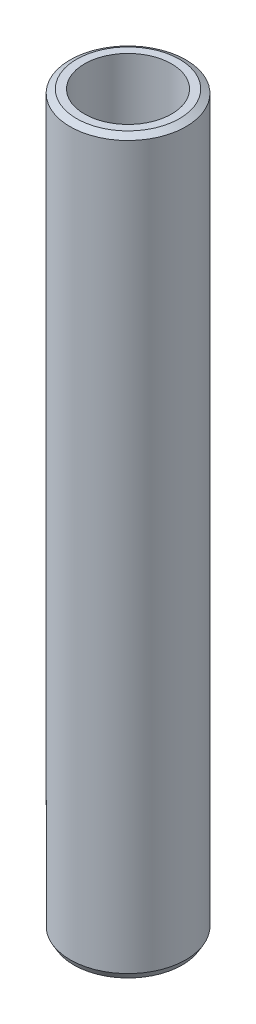
ISO-10303-21;
HEADER;
FILE_DESCRIPTION(('STEP AP214'),'2;1');
FILE_NAME('part.step','',(''),(''),'','','');
FILE_SCHEMA(('AUTOMOTIVE_DESIGN { 1 0 10303 214 1 1 1 1 }'));
ENDSEC;
DATA;
#1=APPLICATION_CONTEXT('core data for automotive mechanical design processes');
#2=APPLICATION_PROTOCOL_DEFINITION('international standard','automotive_design',2000,#1);
#3=PRODUCT_CONTEXT('',#1,'mechanical');
#4=PRODUCT('Part','Part','',(#3));
#5=PRODUCT_RELATED_PRODUCT_CATEGORY('part','',(#4));
#6=PRODUCT_DEFINITION_FORMATION('','',#4);
#7=PRODUCT_DEFINITION_CONTEXT('part definition',#1,'design');
#8=PRODUCT_DEFINITION('design','',#6,#7);
#9=PRODUCT_DEFINITION_SHAPE('','',#8);
#10=(LENGTH_UNIT() NAMED_UNIT(*) SI_UNIT(.MILLI.,.METRE.));
#11=(NAMED_UNIT(*) PLANE_ANGLE_UNIT() SI_UNIT($,.RADIAN.));
#12=(NAMED_UNIT(*) SI_UNIT($,.STERADIAN.) SOLID_ANGLE_UNIT());
#13=UNCERTAINTY_MEASURE_WITH_UNIT(LENGTH_MEASURE(1.E-05),#10,'distance_accuracy_value','');
#14=(GEOMETRIC_REPRESENTATION_CONTEXT(3) GLOBAL_UNCERTAINTY_ASSIGNED_CONTEXT((#13)) GLOBAL_UNIT_ASSIGNED_CONTEXT((#10,
#11,#12)) REPRESENTATION_CONTEXT('',''));
#15=CARTESIAN_POINT('',(0.,0.,0.));
#16=DIRECTION('',(0.,0.,1.));
#17=DIRECTION('',(1.,0.,0.));
#18=AXIS2_PLACEMENT_3D('',#15,#16,#17);
#19=CARTESIAN_POINT('',(0.,600.,0.));
#20=DIRECTION('',(0.,-1.,0.));
#21=DIRECTION('',(0.,0.,-1.));
#22=AXIS2_PLACEMENT_3D('',#19,#20,#21);
#23=CYLINDRICAL_SURFACE('',#22,47.5);
#24=CARTESIAN_POINT('',(0.,596.937892581674,0.));
#25=DIRECTION('',(0.,1.,0.));
#26=DIRECTION('',(0.,0.,1.));
#27=AXIS2_PLACEMENT_3D('',#24,#25,#26);
#28=CIRCLE('',#27,47.5);
#29=CARTESIAN_POINT('',(0.,596.937892581674,-47.5000000000001));
#30=VERTEX_POINT('',#29);
#31=EDGE_CURVE('E50',#30,#30,#28,.F.);
#32=ORIENTED_EDGE('',*,*,#31,.T.);
#33=EDGE_LOOP('',(#32));
#34=FACE_BOUND('',#33,.T.);
#35=CARTESIAN_POINT('',(0.,5.30372562677439,0.));
#36=DIRECTION('',(0.,1.,0.));
#37=DIRECTION('',(0.,0.,1.));
#38=AXIS2_PLACEMENT_3D('',#35,#36,#37);
#39=CIRCLE('',#38,47.5);
#40=CARTESIAN_POINT('',(0.,5.30372562677439,47.5));
#41=VERTEX_POINT('',#40);
#42=EDGE_CURVE('E51',#41,#41,#39,.T.);
#43=ORIENTED_EDGE('',*,*,#42,.T.);
#44=EDGE_LOOP('',(#43));
#45=FACE_BOUND('',#44,.T.);
#46=ADVANCED_FACE('F39',(#34,#45),#23,.T.);
#47=CARTESIAN_POINT('',(0.,600.,0.));
#48=DIRECTION('',(0.,1.,0.));
#49=DIRECTION('',(0.,0.,1.));
#50=AXIS2_PLACEMENT_3D('',#47,#48,#49);
#51=PLANE('',#50);
#52=CARTESIAN_POINT('',(0.,600.,0.));
#53=DIRECTION('',(0.,1.,0.));
#54=DIRECTION('',(0.,0.,1.));
#55=AXIS2_PLACEMENT_3D('',#52,#53,#54);
#56=CIRCLE('',#55,42.1962743732255);
#57=CARTESIAN_POINT('',(0.,600.,-42.1962743732256));
#58=VERTEX_POINT('',#57);
#59=EDGE_CURVE('E54',#58,#58,#56,.T.);
#60=ORIENTED_EDGE('',*,*,#59,.T.);
#61=EDGE_LOOP('',(#60));
#62=FACE_BOUND('',#61,.T.);
#63=CARTESIAN_POINT('',(0.,600.,0.));
#64=DIRECTION('',(0.,1.,0.));
#65=DIRECTION('',(0.,0.,1.));
#66=AXIS2_PLACEMENT_3D('',#63,#64,#65);
#67=CIRCLE('',#66,35.6935095895603);
#68=CARTESIAN_POINT('',(0.,600.,35.6935095895603));
#69=VERTEX_POINT('',#68);
#70=EDGE_CURVE('E58',#69,#69,#67,.T.);
#71=ORIENTED_EDGE('',*,*,#70,.F.);
#72=EDGE_LOOP('',(#71));
#73=FACE_BOUND('',#72,.T.);
#74=ADVANCED_FACE('F69',(#62,#73),#51,.T.);
#75=CARTESIAN_POINT('',(0.,0.,0.));
#76=DIRECTION('',(0.,1.,0.));
#77=DIRECTION('',(0.,0.,1.));
#78=AXIS2_PLACEMENT_3D('',#75,#76,#77);
#79=PLANE('',#78);
#80=CARTESIAN_POINT('',(0.,0.,0.));
#81=DIRECTION('',(0.,1.,0.));
#82=DIRECTION('',(0.,0.,1.));
#83=AXIS2_PLACEMENT_3D('',#80,#81,#82);
#84=CIRCLE('',#83,44.4378925816739);
#85=CARTESIAN_POINT('',(0.,0.,44.4378925816739));
#86=VERTEX_POINT('',#85);
#87=EDGE_CURVE('E10',#86,#86,#84,.F.);
#88=ORIENTED_EDGE('',*,*,#87,.T.);
#89=EDGE_LOOP('',(#88));
#90=FACE_BOUND('',#89,.T.);
#91=CARTESIAN_POINT('',(0.,0.,0.));
#92=DIRECTION('',(0.,1.,0.));
#93=DIRECTION('',(0.,0.,1.));
#94=AXIS2_PLACEMENT_3D('',#91,#92,#93);
#95=CIRCLE('',#94,35.6935095895603);
#96=CARTESIAN_POINT('',(0.,0.,35.6935095895603));
#97=VERTEX_POINT('',#96);
#98=EDGE_CURVE('E63',#97,#97,#95,.T.);
#99=ORIENTED_EDGE('',*,*,#98,.T.);
#100=EDGE_LOOP('',(#99));
#101=FACE_BOUND('',#100,.T.);
#102=ADVANCED_FACE('F75',(#90,#101),#79,.F.);
#103=CARTESIAN_POINT('',(0.,600.,0.));
#104=DIRECTION('',(0.,-1.,0.));
#105=DIRECTION('',(0.,0.,-1.));
#106=AXIS2_PLACEMENT_3D('',#103,#104,#105);
#107=CYLINDRICAL_SURFACE('',#106,35.6935095895603);
#108=ORIENTED_EDGE('',*,*,#70,.T.);
#109=EDGE_LOOP('',(#108));
#110=FACE_BOUND('',#109,.T.);
#111=ORIENTED_EDGE('',*,*,#98,.F.);
#112=EDGE_LOOP('',(#111));
#113=FACE_BOUND('',#112,.T.);
#114=ADVANCED_FACE('F70',(#110,#113),#107,.F.);
#115=CARTESIAN_POINT('',(0.,600.,0.));
#116=DIRECTION('',(0.,-1.,0.));
#117=DIRECTION('',(0.,0.,-1.));
#118=AXIS2_PLACEMENT_3D('',#115,#116,#117);
#119=CONICAL_SURFACE('',#118,42.1962743732255,1.04719755119659);
#120=CARTESIAN_POINT('',(0.,596.937892581674,-47.5000000000001));
#121=CARTESIAN_POINT('',(0.,596.969789533948,-47.4447528580545));
#122=CARTESIAN_POINT('',(0.,597.001686486222,-47.389505716109));
#123=CARTESIAN_POINT('',(0.,597.065480390771,-47.2790114322178));
#124=CARTESIAN_POINT('',(0.,597.097377343045,-47.2237642902723));
#125=CARTESIAN_POINT('',(0.,597.161171247593,-47.1132700063811));
#126=CARTESIAN_POINT('',(0.,597.193068199868,-47.0580228644356));
#127=CARTESIAN_POINT('',(0.,597.256862104416,-46.9475285805444));
#128=CARTESIAN_POINT('',(0.,597.28875905669,-46.8922814385989));
#129=CARTESIAN_POINT('',(0.,597.352552961239,-46.7817871547077));
#130=CARTESIAN_POINT('',(0.,597.384449913513,-46.7265400127622));
#131=CARTESIAN_POINT('',(0.,597.448243818061,-46.616045728871));
#132=CARTESIAN_POINT('',(0.,597.480140770336,-46.5607985869254));
#133=CARTESIAN_POINT('',(0.,597.543934674884,-46.4503043030343));
#134=CARTESIAN_POINT('',(0.,597.575831627158,-46.3950571610887));
#135=CARTESIAN_POINT('',(0.,597.639625531707,-46.2845628771976));
#136=CARTESIAN_POINT('',(0.,597.671522483981,-46.229315735252));
#137=CARTESIAN_POINT('',(0.,597.73531638853,-46.1188214513609));
#138=CARTESIAN_POINT('',(0.,597.767213340804,-46.0635743094153));
#139=CARTESIAN_POINT('',(0.,597.831007245352,-45.9530800255242));
#140=CARTESIAN_POINT('',(0.,597.862904197626,-45.8978328835786));
#141=CARTESIAN_POINT('',(0.,597.926698102175,-45.7873385996875));
#142=CARTESIAN_POINT('',(0.,597.958595054449,-45.7320914577419));
#143=CARTESIAN_POINT('',(0.,598.022388958997,-45.6215971738508));
#144=CARTESIAN_POINT('',(0.,598.054285911272,-45.5663500319052));
#145=CARTESIAN_POINT('',(0.,598.11807981582,-45.4558557480141));
#146=CARTESIAN_POINT('',(0.,598.149976768094,-45.4006086060685));
#147=CARTESIAN_POINT('',(0.,598.213770672643,-45.2901143221774));
#148=CARTESIAN_POINT('',(0.,598.245667624917,-45.2348671802318));
#149=CARTESIAN_POINT('',(0.,598.309461529466,-45.1243728963407));
#150=CARTESIAN_POINT('',(0.,598.34135848174,-45.0691257543951));
#151=CARTESIAN_POINT('',(0.,598.405152386288,-44.958631470504));
#152=CARTESIAN_POINT('',(0.,598.437049338563,-44.9033843285584));
#153=CARTESIAN_POINT('',(0.,598.500843243111,-44.7928900446673));
#154=CARTESIAN_POINT('',(0.,598.532740195385,-44.7376429027217));
#155=CARTESIAN_POINT('',(0.,598.596534099934,-44.6271486188306));
#156=CARTESIAN_POINT('',(0.,598.628431052208,-44.571901476885));
#157=CARTESIAN_POINT('',(0.,598.692224956756,-44.4614071929939));
#158=CARTESIAN_POINT('',(0.,598.724121909031,-44.4061600510483));
#159=CARTESIAN_POINT('',(0.,598.787915813579,-44.2956657671572));
#160=CARTESIAN_POINT('',(0.,598.819812765853,-44.2404186252116));
#161=CARTESIAN_POINT('',(0.,598.883606670402,-44.1299243413205));
#162=CARTESIAN_POINT('',(0.,598.915503622676,-44.0746771993749));
#163=CARTESIAN_POINT('',(0.,598.979297527225,-43.9641829154838));
#164=CARTESIAN_POINT('',(0.,599.011194479499,-43.9089357735382));
#165=CARTESIAN_POINT('',(0.,599.074988384047,-43.798441489647));
#166=CARTESIAN_POINT('',(0.,599.106885336321,-43.7431943477015));
#167=CARTESIAN_POINT('',(0.,599.17067924087,-43.6327000638103));
#168=CARTESIAN_POINT('',(0.,599.202576193144,-43.5774529218648));
#169=CARTESIAN_POINT('',(0.,599.266370097693,-43.4669586379736));
#170=CARTESIAN_POINT('',(0.,599.298267049967,-43.4117114960281));
#171=CARTESIAN_POINT('',(0.,599.362060954515,-43.3012172121369));
#172=CARTESIAN_POINT('',(0.,599.39395790679,-43.2459700701914));
#173=CARTESIAN_POINT('',(0.,599.457751811338,-43.1354757863002));
#174=CARTESIAN_POINT('',(0.,599.489648763612,-43.0802286443547));
#175=CARTESIAN_POINT('',(0.,599.553442668161,-42.9697343604635));
#176=CARTESIAN_POINT('',(0.,599.585339620435,-42.914487218518));
#177=CARTESIAN_POINT('',(0.,599.649133524983,-42.8039929346268));
#178=CARTESIAN_POINT('',(0.,599.681030477258,-42.7487457926813));
#179=CARTESIAN_POINT('',(0.,599.744824381806,-42.6382515087901));
#180=CARTESIAN_POINT('',(0.,599.77672133408,-42.5830043668446));
#181=CARTESIAN_POINT('',(0.,599.840515238629,-42.4725100829534));
#182=CARTESIAN_POINT('',(0.,599.872412190903,-42.4172629410079));
#183=CARTESIAN_POINT('',(0.,599.936206095452,-42.3067686571167));
#184=CARTESIAN_POINT('',(0.,599.968103047726,-42.2515215151711));
#185=CARTESIAN_POINT('',(0.,600.,-42.1962743732256));
#186=B_SPLINE_CURVE_WITH_KNOTS('',3,(#120,#121,#122,#123,#124,#125,#126,#127,#128,#129,#130,
#131,#132,#133,#134,#135,#136,#137,#138,#139,#140,#141,#142,#143,#144,#145,#146,#147,#148,#149,
#150,#151,#152,#153,#154,#155,#156,#157,#158,#159,#160,#161,#162,#163,#164,#165,#166,#167,#168,
#169,#170,#171,#172,#173,#174,#175,#176,#177,#178,#179,#180,#181,#182,#183,#184,#185),
.UNSPECIFIED.,.F.,.F.,(4,2,2,2,2,2,2,2,2,2,2,2,2,2,2,2,2,2,2,2,2,2,2,2,2,2,2,2,2,2,2,2,4),(0.,
0.191381713645392,0.382763427290784,0.574145140936177,0.765526854581569,0.956908568226961,
1.14829028187236,1.33967199551775,1.53105370916314,1.72243542280854,1.91381713645393,
2.10519885009926,2.29658056374466,2.48796227739005,2.67934399103544,2.87072570468083,
3.06210741832623,3.25348913197163,3.44487084561702,3.63625255926241,3.8276342729078,
4.01901598655319,4.21039770019853,4.40177941384392,4.59316112748931,4.78454284113471,
4.9759245547801,5.1673062684255,5.35868798207089,5.55006969571628,5.74145140936167,
5.93283312300706,6.12421483665246),.UNSPECIFIED.);
#187=EDGE_CURVE('BSEAM81',#30,#58,#186,.T.);
#188=ORIENTED_EDGE('',*,*,#31,.F.);
#189=ORIENTED_EDGE('',*,*,#59,.F.);
#190=ORIENTED_EDGE('',*,*,#187,.T.);
#191=ORIENTED_EDGE('',*,*,#187,.F.);
#192=EDGE_LOOP('',(#188,#190,#189,#191));
#193=FACE_BOUND('',#192,.T.);
#194=ADVANCED_FACE('F81',(#193),#119,.T.);
#195=CARTESIAN_POINT('',(0.,5.30372562677439,0.));
#196=DIRECTION('',(0.,1.,0.));
#197=DIRECTION('',(0.,0.,1.));
#198=AXIS2_PLACEMENT_3D('',#195,#196,#197);
#199=CONICAL_SURFACE('',#198,47.5,0.523598775598305);
#200=ORIENTED_EDGE('',*,*,#87,.F.);
#201=EDGE_LOOP('',(#200));
#202=FACE_BOUND('',#201,.T.);
#203=ORIENTED_EDGE('',*,*,#42,.F.);
#204=EDGE_LOOP('',(#203));
#205=FACE_BOUND('',#204,.T.);
#206=ADVANCED_FACE('F45',(#202,#205),#199,.T.);
#207=CLOSED_SHELL('',(#46,#74,#102,#114,#194,#206));
#208=MANIFOLD_SOLID_BREP('B2',#207);
#209=ADVANCED_BREP_SHAPE_REPRESENTATION('',(#18,#208),#14);
#210=SHAPE_DEFINITION_REPRESENTATION(#9,#209);
ENDSEC;
END-ISO-10303-21;
